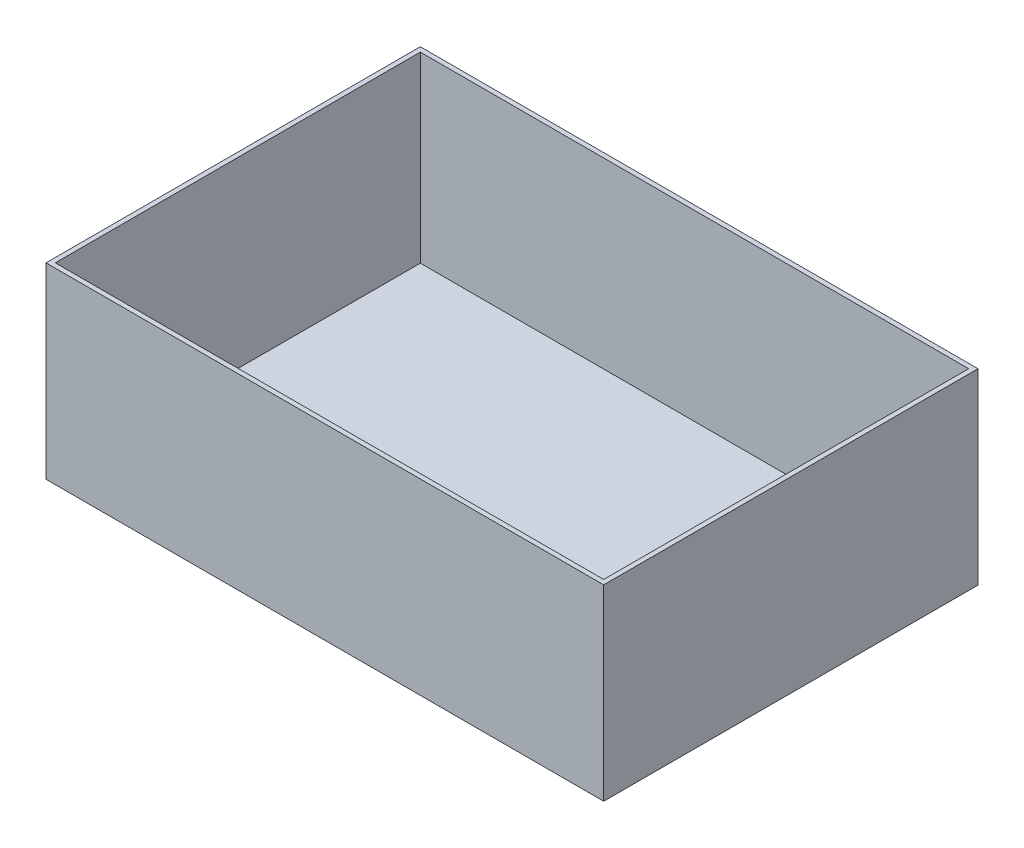
ISO-10303-21;
HEADER;
FILE_DESCRIPTION(('STEP AP214'),'2;1');
FILE_NAME('part.step','',(''),(''),'','','');
FILE_SCHEMA(('AUTOMOTIVE_DESIGN { 1 0 10303 214 1 1 1 1 }'));
ENDSEC;
DATA;
#1=APPLICATION_CONTEXT('core data for automotive mechanical design processes');
#2=APPLICATION_PROTOCOL_DEFINITION('international standard','automotive_design',2000,#1);
#3=PRODUCT_CONTEXT('',#1,'mechanical');
#4=PRODUCT('Part','Part','',(#3));
#5=PRODUCT_RELATED_PRODUCT_CATEGORY('part','',(#4));
#6=PRODUCT_DEFINITION_FORMATION('','',#4);
#7=PRODUCT_DEFINITION_CONTEXT('part definition',#1,'design');
#8=PRODUCT_DEFINITION('design','',#6,#7);
#9=PRODUCT_DEFINITION_SHAPE('','',#8);
#10=(LENGTH_UNIT() NAMED_UNIT(*) SI_UNIT(.MILLI.,.METRE.));
#11=(NAMED_UNIT(*) PLANE_ANGLE_UNIT() SI_UNIT($,.RADIAN.));
#12=(NAMED_UNIT(*) SI_UNIT($,.STERADIAN.) SOLID_ANGLE_UNIT());
#13=UNCERTAINTY_MEASURE_WITH_UNIT(LENGTH_MEASURE(1.E-05),#10,'distance_accuracy_value','');
#14=(GEOMETRIC_REPRESENTATION_CONTEXT(3) GLOBAL_UNCERTAINTY_ASSIGNED_CONTEXT((#13)) GLOBAL_UNIT_ASSIGNED_CONTEXT((#10,
#11,#12)) REPRESENTATION_CONTEXT('',''));
#15=CARTESIAN_POINT('',(0.,0.,0.));
#16=DIRECTION('',(0.,0.,1.));
#17=DIRECTION('',(1.,0.,0.));
#18=AXIS2_PLACEMENT_3D('',#15,#16,#17);
#19=CARTESIAN_POINT('',(0.,200.,0.));
#20=DIRECTION('',(0.,-1.,0.));
#21=DIRECTION('',(0.,0.,-1.));
#22=AXIS2_PLACEMENT_3D('',#19,#20,#21);
#23=PLANE('',#22);
#24=DIRECTION('',(0.,0.,1.));
#25=VECTOR('',#24,1.);
#26=CARTESIAN_POINT('',(-5.08,200.,0.));
#27=LINE('',#26,#25);
#28=CARTESIAN_POINT('',(-5.08,200.,-404.46));
#29=VERTEX_POINT('',#28);
#30=CARTESIAN_POINT('',(-5.08,200.,5.08));
#31=VERTEX_POINT('',#30);
#32=EDGE_CURVE('E160',#29,#31,#27,.T.);
#33=ORIENTED_EDGE('',*,*,#32,.T.);
#34=DIRECTION('',(1.,0.,0.));
#35=VECTOR('',#34,1.);
#36=CARTESIAN_POINT('',(0.,200.,5.08));
#37=LINE('',#36,#35);
#38=CARTESIAN_POINT('',(605.08,200.,5.08));
#39=VERTEX_POINT('',#38);
#40=EDGE_CURVE('E162',#31,#39,#37,.T.);
#41=ORIENTED_EDGE('',*,*,#40,.T.);
#42=DIRECTION('',(0.,0.,-1.));
#43=VECTOR('',#42,1.);
#44=CARTESIAN_POINT('',(605.08,200.,0.));
#45=LINE('',#44,#43);
#46=CARTESIAN_POINT('',(605.08,200.,-404.46));
#47=VERTEX_POINT('',#46);
#48=EDGE_CURVE('E163',#39,#47,#45,.T.);
#49=ORIENTED_EDGE('',*,*,#48,.T.);
#50=DIRECTION('',(-1.,0.,0.));
#51=VECTOR('',#50,1.);
#52=CARTESIAN_POINT('',(0.,200.,-404.46));
#53=LINE('',#52,#51);
#54=EDGE_CURVE('E41',#47,#29,#53,.T.);
#55=ORIENTED_EDGE('',*,*,#54,.T.);
#56=EDGE_LOOP('',(#33,#41,#49,#55));
#57=FACE_BOUND('',#56,.T.);
#58=DIRECTION('',(0.,0.,1.));
#59=VECTOR('',#58,1.);
#60=CARTESIAN_POINT('',(0.,200.,0.));
#61=LINE('',#60,#59);
#62=CARTESIAN_POINT('',(0.,200.,-399.38));
#63=VERTEX_POINT('',#62);
#64=CARTESIAN_POINT('',(0.,200.,0.));
#65=VERTEX_POINT('',#64);
#66=EDGE_CURVE('E106',#63,#65,#61,.T.);
#67=ORIENTED_EDGE('',*,*,#66,.F.);
#68=DIRECTION('',(-1.,0.,0.));
#69=VECTOR('',#68,1.);
#70=CARTESIAN_POINT('',(0.,200.,-399.38));
#71=LINE('',#70,#69);
#72=CARTESIAN_POINT('',(600.,200.,-399.38));
#73=VERTEX_POINT('',#72);
#74=EDGE_CURVE('E131',#73,#63,#71,.T.);
#75=ORIENTED_EDGE('',*,*,#74,.F.);
#76=DIRECTION('',(0.,0.,-1.));
#77=VECTOR('',#76,1.);
#78=CARTESIAN_POINT('',(600.,200.,0.));
#79=LINE('',#78,#77);
#80=CARTESIAN_POINT('',(600.,200.,0.));
#81=VERTEX_POINT('',#80);
#82=EDGE_CURVE('E129',#81,#73,#79,.T.);
#83=ORIENTED_EDGE('',*,*,#82,.F.);
#84=DIRECTION('',(1.,0.,0.));
#85=VECTOR('',#84,1.);
#86=CARTESIAN_POINT('',(0.,200.,0.));
#87=LINE('',#86,#85);
#88=EDGE_CURVE('E117',#65,#81,#87,.T.);
#89=ORIENTED_EDGE('',*,*,#88,.F.);
#90=EDGE_LOOP('',(#67,#75,#83,#89));
#91=FACE_BOUND('',#90,.T.);
#92=ADVANCED_FACE('F37',(#57,#91),#23,.F.);
#93=CARTESIAN_POINT('',(-5.08,200.,0.));
#94=DIRECTION('',(1.,0.,0.));
#95=DIRECTION('',(0.,0.,-1.));
#96=AXIS2_PLACEMENT_3D('',#93,#94,#95);
#97=PLANE('',#96);
#98=DIRECTION('',(0.,0.,1.));
#99=VECTOR('',#98,1.);
#100=CARTESIAN_POINT('',(-5.08,-5.08,0.));
#101=LINE('',#100,#99);
#102=CARTESIAN_POINT('',(-5.08,-5.08,-404.46));
#103=VERTEX_POINT('',#102);
#104=CARTESIAN_POINT('',(-5.08,-5.08,5.08));
#105=VERTEX_POINT('',#104);
#106=EDGE_CURVE('E125',#103,#105,#101,.T.);
#107=ORIENTED_EDGE('',*,*,#106,.T.);
#108=DIRECTION('',(0.,-1.,0.));
#109=VECTOR('',#108,1.);
#110=CARTESIAN_POINT('',(-5.08,200.,5.08));
#111=LINE('',#110,#109);
#112=EDGE_CURVE('E11',#31,#105,#111,.T.);
#113=ORIENTED_EDGE('',*,*,#112,.F.);
#114=ORIENTED_EDGE('',*,*,#32,.F.);
#115=DIRECTION('',(0.,-1.,0.));
#116=VECTOR('',#115,1.);
#117=CARTESIAN_POINT('',(-5.08,200.,-404.46));
#118=LINE('',#117,#116);
#119=EDGE_CURVE('E147',#29,#103,#118,.T.);
#120=ORIENTED_EDGE('',*,*,#119,.T.);
#121=EDGE_LOOP('',(#107,#113,#114,#120));
#122=FACE_BOUND('',#121,.T.);
#123=ADVANCED_FACE('F177',(#122),#97,.F.);
#124=CARTESIAN_POINT('',(0.,200.,5.08));
#125=DIRECTION('',(0.,0.,-1.));
#126=DIRECTION('',(-1.,0.,0.));
#127=AXIS2_PLACEMENT_3D('',#124,#125,#126);
#128=PLANE('',#127);
#129=DIRECTION('',(1.,0.,0.));
#130=VECTOR('',#129,1.);
#131=CARTESIAN_POINT('',(0.,-5.08,5.08));
#132=LINE('',#131,#130);
#133=CARTESIAN_POINT('',(605.08,-5.08,5.08));
#134=VERTEX_POINT('',#133);
#135=EDGE_CURVE('E145',#105,#134,#132,.T.);
#136=ORIENTED_EDGE('',*,*,#135,.T.);
#137=DIRECTION('',(0.,-1.,0.));
#138=VECTOR('',#137,1.);
#139=CARTESIAN_POINT('',(605.08,200.,5.08));
#140=LINE('',#139,#138);
#141=EDGE_CURVE('E46',#39,#134,#140,.T.);
#142=ORIENTED_EDGE('',*,*,#141,.F.);
#143=ORIENTED_EDGE('',*,*,#40,.F.);
#144=ORIENTED_EDGE('',*,*,#112,.T.);
#145=EDGE_LOOP('',(#136,#142,#143,#144));
#146=FACE_BOUND('',#145,.T.);
#147=ADVANCED_FACE('F179',(#146),#128,.F.);
#148=CARTESIAN_POINT('',(605.08,200.,0.));
#149=DIRECTION('',(-1.,0.,0.));
#150=DIRECTION('',(0.,0.,1.));
#151=AXIS2_PLACEMENT_3D('',#148,#149,#150);
#152=PLANE('',#151);
#153=DIRECTION('',(0.,0.,-1.));
#154=VECTOR('',#153,1.);
#155=CARTESIAN_POINT('',(605.08,-5.08,0.));
#156=LINE('',#155,#154);
#157=CARTESIAN_POINT('',(605.08,-5.08,-404.46));
#158=VERTEX_POINT('',#157);
#159=EDGE_CURVE('E152',#134,#158,#156,.T.);
#160=ORIENTED_EDGE('',*,*,#159,.T.);
#161=DIRECTION('',(0.,-1.,0.));
#162=VECTOR('',#161,1.);
#163=CARTESIAN_POINT('',(605.08,200.,-404.46));
#164=LINE('',#163,#162);
#165=EDGE_CURVE('E150',#47,#158,#164,.T.);
#166=ORIENTED_EDGE('',*,*,#165,.F.);
#167=ORIENTED_EDGE('',*,*,#48,.F.);
#168=ORIENTED_EDGE('',*,*,#141,.T.);
#169=EDGE_LOOP('',(#160,#166,#167,#168));
#170=FACE_BOUND('',#169,.T.);
#171=ADVANCED_FACE('F168',(#170),#152,.F.);
#172=CARTESIAN_POINT('',(0.,200.,-404.46));
#173=DIRECTION('',(0.,0.,1.));
#174=DIRECTION('',(1.,0.,0.));
#175=AXIS2_PLACEMENT_3D('',#172,#173,#174);
#176=PLANE('',#175);
#177=DIRECTION('',(-1.,0.,0.));
#178=VECTOR('',#177,1.);
#179=CARTESIAN_POINT('',(0.,-5.08,-404.46));
#180=LINE('',#179,#178);
#181=EDGE_CURVE('E156',#158,#103,#180,.T.);
#182=ORIENTED_EDGE('',*,*,#181,.T.);
#183=ORIENTED_EDGE('',*,*,#119,.F.);
#184=ORIENTED_EDGE('',*,*,#54,.F.);
#185=ORIENTED_EDGE('',*,*,#165,.T.);
#186=EDGE_LOOP('',(#182,#183,#184,#185));
#187=FACE_BOUND('',#186,.T.);
#188=ADVANCED_FACE('F172',(#187),#176,.F.);
#189=CARTESIAN_POINT('',(0.,-5.08,0.));
#190=DIRECTION('',(0.,-1.,0.));
#191=DIRECTION('',(0.,0.,-1.));
#192=AXIS2_PLACEMENT_3D('',#189,#190,#191);
#193=PLANE('',#192);
#194=ORIENTED_EDGE('',*,*,#106,.F.);
#195=ORIENTED_EDGE('',*,*,#181,.F.);
#196=ORIENTED_EDGE('',*,*,#159,.F.);
#197=ORIENTED_EDGE('',*,*,#135,.F.);
#198=EDGE_LOOP('',(#194,#195,#196,#197));
#199=FACE_BOUND('',#198,.T.);
#200=ADVANCED_FACE('F39',(#199),#193,.T.);
#201=CARTESIAN_POINT('',(0.,200.,0.));
#202=DIRECTION('',(1.,0.,0.));
#203=DIRECTION('',(0.,0.,-1.));
#204=AXIS2_PLACEMENT_3D('',#201,#202,#203);
#205=PLANE('',#204);
#206=DIRECTION('',(0.,0.,1.));
#207=VECTOR('',#206,1.);
#208=CARTESIAN_POINT('',(0.,0.,0.));
#209=LINE('',#208,#207);
#210=CARTESIAN_POINT('',(0.,0.,-399.38));
#211=VERTEX_POINT('',#210);
#212=CARTESIAN_POINT('',(0.,0.,0.));
#213=VERTEX_POINT('',#212);
#214=EDGE_CURVE('E135',#211,#213,#209,.T.);
#215=ORIENTED_EDGE('',*,*,#214,.F.);
#216=DIRECTION('',(0.,-1.,0.));
#217=VECTOR('',#216,1.);
#218=CARTESIAN_POINT('',(0.,200.,-399.38));
#219=LINE('',#218,#217);
#220=EDGE_CURVE('E113',#63,#211,#219,.T.);
#221=ORIENTED_EDGE('',*,*,#220,.F.);
#222=ORIENTED_EDGE('',*,*,#66,.T.);
#223=DIRECTION('',(0.,-1.,0.));
#224=VECTOR('',#223,1.);
#225=CARTESIAN_POINT('',(0.,200.,0.));
#226=LINE('',#225,#224);
#227=EDGE_CURVE('E110',#65,#213,#226,.T.);
#228=ORIENTED_EDGE('',*,*,#227,.T.);
#229=EDGE_LOOP('',(#215,#221,#222,#228));
#230=FACE_BOUND('',#229,.T.);
#231=ADVANCED_FACE('F109',(#230),#205,.T.);
#232=CARTESIAN_POINT('',(0.,200.,0.));
#233=DIRECTION('',(0.,0.,-1.));
#234=DIRECTION('',(-1.,0.,0.));
#235=AXIS2_PLACEMENT_3D('',#232,#233,#234);
#236=PLANE('',#235);
#237=DIRECTION('',(1.,0.,0.));
#238=VECTOR('',#237,1.);
#239=CARTESIAN_POINT('',(0.,0.,0.));
#240=LINE('',#239,#238);
#241=CARTESIAN_POINT('',(600.,0.,0.));
#242=VERTEX_POINT('',#241);
#243=EDGE_CURVE('E124',#213,#242,#240,.T.);
#244=ORIENTED_EDGE('',*,*,#243,.F.);
#245=ORIENTED_EDGE('',*,*,#227,.F.);
#246=ORIENTED_EDGE('',*,*,#88,.T.);
#247=DIRECTION('',(0.,-1.,0.));
#248=VECTOR('',#247,1.);
#249=CARTESIAN_POINT('',(600.,200.,0.));
#250=LINE('',#249,#248);
#251=EDGE_CURVE('E126',#81,#242,#250,.T.);
#252=ORIENTED_EDGE('',*,*,#251,.T.);
#253=EDGE_LOOP('',(#244,#245,#246,#252));
#254=FACE_BOUND('',#253,.T.);
#255=ADVANCED_FACE('F121',(#254),#236,.T.);
#256=CARTESIAN_POINT('',(600.,200.,0.));
#257=DIRECTION('',(-1.,0.,0.));
#258=DIRECTION('',(0.,0.,1.));
#259=AXIS2_PLACEMENT_3D('',#256,#257,#258);
#260=PLANE('',#259);
#261=DIRECTION('',(0.,0.,-1.));
#262=VECTOR('',#261,1.);
#263=CARTESIAN_POINT('',(600.,0.,0.));
#264=LINE('',#263,#262);
#265=CARTESIAN_POINT('',(600.,0.,-399.38));
#266=VERTEX_POINT('',#265);
#267=EDGE_CURVE('E138',#242,#266,#264,.T.);
#268=ORIENTED_EDGE('',*,*,#267,.F.);
#269=ORIENTED_EDGE('',*,*,#251,.F.);
#270=ORIENTED_EDGE('',*,*,#82,.T.);
#271=DIRECTION('',(0.,-1.,0.));
#272=VECTOR('',#271,1.);
#273=CARTESIAN_POINT('',(600.,200.,-399.38));
#274=LINE('',#273,#272);
#275=EDGE_CURVE('E54',#73,#266,#274,.T.);
#276=ORIENTED_EDGE('',*,*,#275,.T.);
#277=EDGE_LOOP('',(#268,#269,#270,#276));
#278=FACE_BOUND('',#277,.T.);
#279=ADVANCED_FACE('F228',(#278),#260,.T.);
#280=CARTESIAN_POINT('',(0.,200.,-399.38));
#281=DIRECTION('',(0.,0.,1.));
#282=DIRECTION('',(1.,0.,0.));
#283=AXIS2_PLACEMENT_3D('',#280,#281,#282);
#284=PLANE('',#283);
#285=DIRECTION('',(-1.,0.,0.));
#286=VECTOR('',#285,1.);
#287=CARTESIAN_POINT('',(0.,0.,-399.38));
#288=LINE('',#287,#286);
#289=EDGE_CURVE('E118',#266,#211,#288,.T.);
#290=ORIENTED_EDGE('',*,*,#289,.F.);
#291=ORIENTED_EDGE('',*,*,#275,.F.);
#292=ORIENTED_EDGE('',*,*,#74,.T.);
#293=ORIENTED_EDGE('',*,*,#220,.T.);
#294=EDGE_LOOP('',(#290,#291,#292,#293));
#295=FACE_BOUND('',#294,.T.);
#296=ADVANCED_FACE('F236',(#295),#284,.T.);
#297=CARTESIAN_POINT('',(0.,0.,0.));
#298=DIRECTION('',(0.,-1.,0.));
#299=DIRECTION('',(0.,0.,-1.));
#300=AXIS2_PLACEMENT_3D('',#297,#298,#299);
#301=PLANE('',#300);
#302=ORIENTED_EDGE('',*,*,#214,.T.);
#303=ORIENTED_EDGE('',*,*,#243,.T.);
#304=ORIENTED_EDGE('',*,*,#267,.T.);
#305=ORIENTED_EDGE('',*,*,#289,.T.);
#306=EDGE_LOOP('',(#302,#303,#304,#305));
#307=FACE_BOUND('',#306,.T.);
#308=ADVANCED_FACE('F246',(#307),#301,.F.);
#309=CLOSED_SHELL('',(#92,#123,#147,#171,#188,#200,#231,#255,#279,#296,#308));
#310=MANIFOLD_SOLID_BREP('B2',#309);
#311=ADVANCED_BREP_SHAPE_REPRESENTATION('',(#18,#310),#14);
#312=SHAPE_DEFINITION_REPRESENTATION(#9,#311);
ENDSEC;
END-ISO-10303-21;
